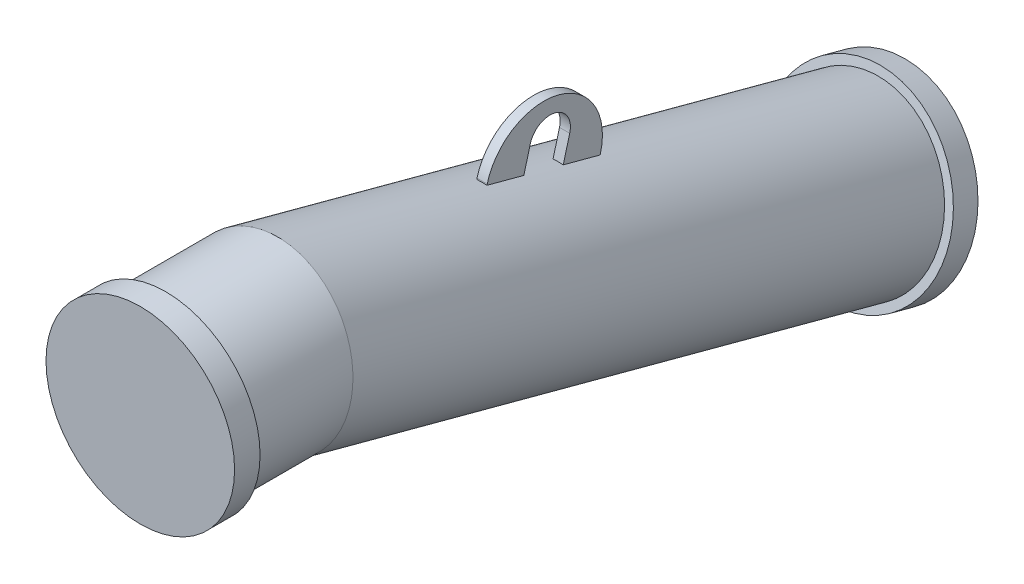
ISO-10303-21;
HEADER;
FILE_DESCRIPTION(('STEP AP214'),'2;1');
FILE_NAME('part.step','',(''),(''),'','','');
FILE_SCHEMA(('AUTOMOTIVE_DESIGN { 1 0 10303 214 1 1 1 1 }'));
ENDSEC;
DATA;
#1=APPLICATION_CONTEXT('core data for automotive mechanical design processes');
#2=APPLICATION_PROTOCOL_DEFINITION('international standard','automotive_design',2000,#1);
#3=PRODUCT_CONTEXT('',#1,'mechanical');
#4=PRODUCT('Part','Part','',(#3));
#5=PRODUCT_RELATED_PRODUCT_CATEGORY('part','',(#4));
#6=PRODUCT_DEFINITION_FORMATION('','',#4);
#7=PRODUCT_DEFINITION_CONTEXT('part definition',#1,'design');
#8=PRODUCT_DEFINITION('design','',#6,#7);
#9=PRODUCT_DEFINITION_SHAPE('','',#8);
#10=(LENGTH_UNIT() NAMED_UNIT(*) SI_UNIT(.MILLI.,.METRE.));
#11=(NAMED_UNIT(*) PLANE_ANGLE_UNIT() SI_UNIT($,.RADIAN.));
#12=(NAMED_UNIT(*) SI_UNIT($,.STERADIAN.) SOLID_ANGLE_UNIT());
#13=UNCERTAINTY_MEASURE_WITH_UNIT(LENGTH_MEASURE(1.E-05),#10,'distance_accuracy_value','');
#14=(GEOMETRIC_REPRESENTATION_CONTEXT(3) GLOBAL_UNCERTAINTY_ASSIGNED_CONTEXT((#13)) GLOBAL_UNIT_ASSIGNED_CONTEXT((#10,
#11,#12)) REPRESENTATION_CONTEXT('',''));
#15=CARTESIAN_POINT('',(0.,0.,0.));
#16=DIRECTION('',(0.,0.,1.));
#17=DIRECTION('',(1.,0.,0.));
#18=AXIS2_PLACEMENT_3D('',#15,#16,#17);
#19=CARTESIAN_POINT('',(0.,-3.60822483003176E-13,-24.9999999999999));
#20=DIRECTION('',(0.,0.,0.999999999999996));
#21=DIRECTION('',(1.,0.,0.));
#22=AXIS2_PLACEMENT_3D('',#19,#20,#21);
#23=CYLINDRICAL_SURFACE('',#22,92.5);
#24=CARTESIAN_POINT('',(0.,-3.60822483003176E-13,-24.9999999999999));
#25=DIRECTION('',(0.,0.,0.999999999999996));
#26=DIRECTION('',(1.,0.,0.));
#27=AXIS2_PLACEMENT_3D('',#24,#25,#26);
#28=CIRCLE('',#27,92.5);
#29=CARTESIAN_POINT('',(92.5000000000001,-3.16711467399868E-13,-24.9999999999999));
#30=VERTEX_POINT('',#29);
#31=EDGE_CURVE('E27',#30,#30,#28,.T.);
#32=ORIENTED_EDGE('',*,*,#31,.T.);
#33=EDGE_LOOP('',(#32));
#34=FACE_BOUND('',#33,.T.);
#35=CARTESIAN_POINT('',(0.,0.,0.));
#36=DIRECTION('',(0.,0.,0.999999999999996));
#37=DIRECTION('',(1.,0.,0.));
#38=AXIS2_PLACEMENT_3D('',#35,#36,#37);
#39=CIRCLE('',#38,92.5);
#40=CARTESIAN_POINT('',(92.5000000000001,0.,0.));
#41=VERTEX_POINT('',#40);
#42=EDGE_CURVE('E20',#41,#41,#39,.T.);
#43=ORIENTED_EDGE('',*,*,#42,.F.);
#44=EDGE_LOOP('',(#43));
#45=FACE_BOUND('',#44,.T.);
#46=ADVANCED_FACE('F17',(#34,#45),#23,.T.);
#47=CARTESIAN_POINT('',(0.,-3.60822483003176E-13,-24.9999999999999));
#48=DIRECTION('',(0.,0.,0.999999999999996));
#49=DIRECTION('',(1.,0.,0.));
#50=AXIS2_PLACEMENT_3D('',#47,#48,#49);
#51=PLANE('',#50);
#52=CARTESIAN_POINT('',(0.,0.,-25.));
#53=DIRECTION('',(0.,0.,-1.));
#54=DIRECTION('',(-1.,0.,0.));
#55=AXIS2_PLACEMENT_3D('',#52,#53,#54);
#56=CIRCLE('',#55,84.15);
#57=CARTESIAN_POINT('',(-84.1500000000002,0.,-25.));
#58=VERTEX_POINT('',#57);
#59=EDGE_CURVE('E10',#58,#58,#56,.T.);
#60=ORIENTED_EDGE('',*,*,#59,.F.);
#61=EDGE_LOOP('',(#60));
#62=FACE_BOUND('',#61,.T.);
#63=ORIENTED_EDGE('',*,*,#31,.F.);
#64=EDGE_LOOP('',(#63));
#65=FACE_BOUND('',#64,.T.);
#66=ADVANCED_FACE('F370',(#62,#65),#51,.F.);
#67=CARTESIAN_POINT('',(5.00000000000008,39.1303698782752,-396.914653295318));
#68=DIRECTION('',(1.,0.,0.));
#69=DIRECTION('',(0.,0.965925826289069,-0.258819045102522));
#70=AXIS2_PLACEMENT_3D('',#67,#68,#69);
#71=PLANE('',#70);
#72=DIRECTION('',(0.,0.965925826289068,-0.258819045102522));
#73=VECTOR('',#72,1.);
#74=CARTESIAN_POINT('',(5.00000000000008,21.6539497909864,-332.703480272761));
#75=LINE('',#74,#73);
#76=CARTESIAN_POINT('',(5.00000000000008,30.348561494267,-335.033194457158));
#77=VERTEX_POINT('',#76);
#78=CARTESIAN_POINT('',(5.00000000000008,31.3132080538771,-335.291670723787));
#79=VERTEX_POINT('',#78);
#80=EDGE_CURVE('E296',#77,#79,#75,.T.);
#81=ORIENTED_EDGE('',*,*,#80,.F.);
#82=DIRECTION('',(0.,-0.258819045102519,-0.96592582628906));
#83=VECTOR('',#82,1.);
#84=CARTESIAN_POINT('',(5.00000000000007,-48.2704738762997,-628.443428902165));
#85=LINE('',#84,#83);
#86=CARTESIAN_POINT('',(5.00000000000008,20.6428473029213,-371.255412942999));
#87=VERTEX_POINT('',#86);
#88=EDGE_CURVE('E52',#77,#87,#85,.T.);
#89=ORIENTED_EDGE('',*,*,#88,.T.);
#90=DIRECTION('',(0.,0.965925826289069,-0.258819045102522));
#91=VECTOR('',#90,1.);
#92=CARTESIAN_POINT('',(5.00000000000009,21.6074938625328,-371.513889209626));
#93=LINE('',#92,#91);
#94=CARTESIAN_POINT('',(5.0000000000001,44.3067507803256,-377.596136769536));
#95=VERTEX_POINT('',#94);
#96=EDGE_CURVE('E309',#87,#95,#93,.T.);
#97=ORIENTED_EDGE('',*,*,#96,.T.);
#98=CARTESIAN_POINT('',(5.00000000000008,39.1303698782752,-396.914653295318));
#99=DIRECTION('',(-1.,0.,0.));
#100=DIRECTION('',(0.,0.965925826289069,-0.258819045102522));
#101=AXIS2_PLACEMENT_3D('',#98,#99,#100);
#102=CIRCLE('',#101,20.);
#103=CARTESIAN_POINT('',(5.00000000000009,33.9539889762251,-416.233169821099));
#104=VERTEX_POINT('',#103);
#105=EDGE_CURVE('E312',#95,#104,#102,.T.);
#106=ORIENTED_EDGE('',*,*,#105,.T.);
#107=DIRECTION('',(0.,-0.965925826289069,0.258819045102521));
#108=VECTOR('',#107,1.);
#109=CARTESIAN_POINT('',(5.00000000000009,11.2547320584318,-410.150922261189));
#110=LINE('',#109,#108);
#111=CARTESIAN_POINT('',(5.00000000000008,10.2900854988205,-409.892445994562));
#112=VERTEX_POINT('',#111);
#113=EDGE_CURVE('E316',#104,#112,#110,.T.);
#114=ORIENTED_EDGE('',*,*,#113,.T.);
#115=CARTESIAN_POINT('',(5.00000000000009,0.584371307477155,-446.1146644804));
#116=VERTEX_POINT('',#115);
#117=EDGE_CURVE('E286',#112,#116,#85,.T.);
#118=ORIENTED_EDGE('',*,*,#117,.T.);
#119=DIRECTION('',(0.,0.965925826289068,-0.258819045102522));
#120=VECTOR('',#119,1.);
#121=CARTESIAN_POINT('',(5.00000000000009,-8.11024039580356,-443.784950296004));
#122=LINE('',#121,#120);
#123=CARTESIAN_POINT('',(5.00000000000009,1.54901786708718,-446.373140747029));
#124=VERTEX_POINT('',#123);
#125=EDGE_CURVE('E302',#116,#124,#122,.T.);
#126=ORIENTED_EDGE('',*,*,#125,.T.);
#127=CARTESIAN_POINT('',(5.00000000000009,16.4311129604822,-390.832405735408));
#128=DIRECTION('',(1.,0.,0.));
#129=DIRECTION('',(0.,0.965925826289069,-0.258819045102522));
#130=AXIS2_PLACEMENT_3D('',#127,#128,#129);
#131=CIRCLE('',#130,57.5);
#132=EDGE_CURVE('E319',#124,#79,#131,.T.);
#133=ORIENTED_EDGE('',*,*,#132,.T.);
#134=EDGE_LOOP('',(#81,#89,#97,#106,#114,#118,#126,#133));
#135=FACE_BOUND('',#134,.T.);
#136=ADVANCED_FACE('F375',(#135),#71,.T.);
#137=CARTESIAN_POINT('',(-4.99999999999992,39.1303698782754,-396.914653295317));
#138=DIRECTION('',(1.,0.,0.));
#139=DIRECTION('',(0.,0.965925826289069,-0.258819045102522));
#140=AXIS2_PLACEMENT_3D('',#137,#138,#139);
#141=PLANE('',#140);
#142=DIRECTION('',(0.,-0.258819045102519,-0.96592582628906));
#143=VECTOR('',#142,1.);
#144=CARTESIAN_POINT('',(-4.99999999999993,-48.2704738762997,-628.443428902165));
#145=LINE('',#144,#143);
#146=CARTESIAN_POINT('',(-4.99999999999992,30.348561494267,-335.033194457158));
#147=VERTEX_POINT('',#146);
#148=CARTESIAN_POINT('',(-4.99999999999992,20.6428473029213,-371.255412942999));
#149=VERTEX_POINT('',#148);
#150=EDGE_CURVE('E278',#147,#149,#145,.T.);
#151=ORIENTED_EDGE('',*,*,#150,.F.);
#152=DIRECTION('',(0.,0.965925826289068,-0.258819045102522));
#153=VECTOR('',#152,1.);
#154=CARTESIAN_POINT('',(-4.99999999999992,21.6539497909864,-332.703480272761));
#155=LINE('',#154,#153);
#156=CARTESIAN_POINT('',(-4.99999999999992,31.3132080538771,-335.291670723787));
#157=VERTEX_POINT('',#156);
#158=EDGE_CURVE('E299',#147,#157,#155,.T.);
#159=ORIENTED_EDGE('',*,*,#158,.T.);
#160=CARTESIAN_POINT('',(-4.99999999999991,16.4311129604822,-390.832405735408));
#161=DIRECTION('',(1.,0.,0.));
#162=DIRECTION('',(0.,0.965925826289069,-0.258819045102522));
#163=AXIS2_PLACEMENT_3D('',#160,#161,#162);
#164=CIRCLE('',#163,57.5);
#165=CARTESIAN_POINT('',(-4.99999999999992,1.54901786708704,-446.37314074703));
#166=VERTEX_POINT('',#165);
#167=EDGE_CURVE('E313',#166,#157,#164,.T.);
#168=ORIENTED_EDGE('',*,*,#167,.F.);
#169=DIRECTION('',(0.,0.965925826289068,-0.258819045102522));
#170=VECTOR('',#169,1.);
#171=CARTESIAN_POINT('',(-4.99999999999992,-8.11024039580364,-443.784950296004));
#172=LINE('',#171,#170);
#173=CARTESIAN_POINT('',(-4.99999999999992,0.584371307477086,-446.114664480401));
#174=VERTEX_POINT('',#173);
#175=EDGE_CURVE('E305',#174,#166,#172,.T.);
#176=ORIENTED_EDGE('',*,*,#175,.F.);
#177=CARTESIAN_POINT('',(-4.99999999999993,10.2900854988205,-409.892445994562));
#178=VERTEX_POINT('',#177);
#179=EDGE_CURVE('E282',#178,#174,#145,.T.);
#180=ORIENTED_EDGE('',*,*,#179,.F.);
#181=DIRECTION('',(0.,-0.965925826289069,0.258819045102521));
#182=VECTOR('',#181,1.);
#183=CARTESIAN_POINT('',(-4.99999999999991,11.2547320584318,-410.150922261189));
#184=LINE('',#183,#182);
#185=CARTESIAN_POINT('',(-4.99999999999991,33.9539889762251,-416.233169821099));
#186=VERTEX_POINT('',#185);
#187=EDGE_CURVE('E329',#186,#178,#184,.T.);
#188=ORIENTED_EDGE('',*,*,#187,.F.);
#189=CARTESIAN_POINT('',(-4.99999999999992,39.1303698782754,-396.914653295317));
#190=DIRECTION('',(-1.,0.,0.));
#191=DIRECTION('',(0.,0.965925826289069,-0.258819045102522));
#192=AXIS2_PLACEMENT_3D('',#189,#190,#191);
#193=CIRCLE('',#192,20.);
#194=CARTESIAN_POINT('',(-4.99999999999991,44.3067507803256,-377.596136769536));
#195=VERTEX_POINT('',#194);
#196=EDGE_CURVE('E326',#195,#186,#193,.T.);
#197=ORIENTED_EDGE('',*,*,#196,.F.);
#198=DIRECTION('',(0.,0.965925826289069,-0.258819045102522));
#199=VECTOR('',#198,1.);
#200=CARTESIAN_POINT('',(-4.99999999999991,21.6074938625327,-371.513889209626));
#201=LINE('',#200,#199);
#202=EDGE_CURVE('E308',#149,#195,#201,.T.);
#203=ORIENTED_EDGE('',*,*,#202,.F.);
#204=EDGE_LOOP('',(#151,#159,#168,#176,#180,#188,#197,#203));
#205=FACE_BOUND('',#204,.T.);
#206=ADVANCED_FACE('F381',(#205),#141,.F.);
#207=CARTESIAN_POINT('',(5.00000000000009,21.6074938625328,-371.513889209626));
#208=DIRECTION('',(0.,0.258819045102522,0.965925826289068));
#209=DIRECTION('',(0.,-0.965925826289069,0.258819045102522));
#210=AXIS2_PLACEMENT_3D('',#207,#208,#209);
#211=PLANE('',#210);
#212=CARTESIAN_POINT('',(0.,-60.4962013720383,-349.514270375912));
#213=DIRECTION('',(0.,0.258819045102522,0.965925826289068));
#214=DIRECTION('',(0.,-0.965925826289068,0.258819045102522));
#215=AXIS2_PLACEMENT_3D('',#212,#213,#214);
#216=CIRCLE('',#215,84.15);
#217=EDGE_CURVE('E285',#149,#87,#216,.F.);
#218=ORIENTED_EDGE('',*,*,#217,.F.);
#219=ORIENTED_EDGE('',*,*,#202,.T.);
#220=DIRECTION('',(-1.,0.,0.));
#221=VECTOR('',#220,1.);
#222=CARTESIAN_POINT('',(5.0000000000001,44.3067507803256,-377.596136769536));
#223=LINE('',#222,#221);
#224=EDGE_CURVE('E346',#95,#195,#223,.T.);
#225=ORIENTED_EDGE('',*,*,#224,.F.);
#226=ORIENTED_EDGE('',*,*,#96,.F.);
#227=EDGE_LOOP('',(#218,#219,#225,#226));
#228=FACE_BOUND('',#227,.T.);
#229=ADVANCED_FACE('F386',(#228),#211,.F.);
#230=CARTESIAN_POINT('',(5.00000000000008,39.1303698782752,-396.914653295318));
#231=DIRECTION('',(-1.,0.,0.));
#232=DIRECTION('',(0.,-0.965925826289069,0.258819045102522));
#233=AXIS2_PLACEMENT_3D('',#230,#231,#232);
#234=CYLINDRICAL_SURFACE('',#233,20.);
#235=ORIENTED_EDGE('',*,*,#196,.T.);
#236=DIRECTION('',(-1.,0.,0.));
#237=VECTOR('',#236,1.);
#238=CARTESIAN_POINT('',(5.00000000000009,33.9539889762251,-416.233169821099));
#239=LINE('',#238,#237);
#240=EDGE_CURVE('E342',#104,#186,#239,.T.);
#241=ORIENTED_EDGE('',*,*,#240,.F.);
#242=ORIENTED_EDGE('',*,*,#105,.F.);
#243=ORIENTED_EDGE('',*,*,#224,.T.);
#244=EDGE_LOOP('',(#235,#241,#242,#243));
#245=FACE_BOUND('',#244,.T.);
#246=ADVANCED_FACE('F425',(#245),#234,.F.);
#247=CARTESIAN_POINT('',(5.00000000000009,11.2547320584318,-410.150922261189));
#248=DIRECTION('',(0.,-0.258819045102521,-0.965925826289069));
#249=DIRECTION('',(0.,0.965925826289069,-0.258819045102521));
#250=AXIS2_PLACEMENT_3D('',#247,#248,#249);
#251=PLANE('',#250);
#252=CARTESIAN_POINT('',(0.,-70.8489631761392,-388.151303427475));
#253=DIRECTION('',(0.,-0.258819045102521,-0.965925826289069));
#254=DIRECTION('',(0.,0.965925826289068,-0.258819045102521));
#255=AXIS2_PLACEMENT_3D('',#252,#253,#254);
#256=CIRCLE('',#255,84.15);
#257=EDGE_CURVE('E40',#112,#178,#256,.F.);
#258=ORIENTED_EDGE('',*,*,#257,.F.);
#259=ORIENTED_EDGE('',*,*,#113,.F.);
#260=ORIENTED_EDGE('',*,*,#240,.T.);
#261=ORIENTED_EDGE('',*,*,#187,.T.);
#262=EDGE_LOOP('',(#258,#259,#260,#261));
#263=FACE_BOUND('',#262,.T.);
#264=ADVANCED_FACE('F422',(#263),#251,.F.);
#265=CARTESIAN_POINT('',(5.00000000000009,16.4311129604822,-390.832405735408));
#266=DIRECTION('',(-1.,0.,0.));
#267=DIRECTION('',(0.,-0.965925826289069,0.258819045102522));
#268=AXIS2_PLACEMENT_3D('',#265,#266,#267);
#269=CYLINDRICAL_SURFACE('',#268,57.5);
#270=ORIENTED_EDGE('',*,*,#167,.T.);
#271=DIRECTION('',(-1.,0.,0.));
#272=VECTOR('',#271,1.);
#273=CARTESIAN_POINT('',(5.00000000000008,31.3132080538771,-335.291670723787));
#274=LINE('',#273,#272);
#275=EDGE_CURVE('E323',#79,#157,#274,.T.);
#276=ORIENTED_EDGE('',*,*,#275,.F.);
#277=ORIENTED_EDGE('',*,*,#132,.F.);
#278=DIRECTION('',(-1.,0.,0.));
#279=VECTOR('',#278,1.);
#280=CARTESIAN_POINT('',(5.00000000000009,1.54901786708718,-446.373140747029));
#281=LINE('',#280,#279);
#282=EDGE_CURVE('E338',#124,#166,#281,.T.);
#283=ORIENTED_EDGE('',*,*,#282,.T.);
#284=EDGE_LOOP('',(#270,#276,#277,#283));
#285=FACE_BOUND('',#284,.T.);
#286=ADVANCED_FACE('F414',(#285),#269,.T.);
#287=CARTESIAN_POINT('',(-4.99999999999992,-8.11024039580364,-443.784950296004));
#288=DIRECTION('',(0.,0.258819045102522,0.965925826289068));
#289=DIRECTION('',(0.,-0.965925826289068,0.258819045102522));
#290=AXIS2_PLACEMENT_3D('',#287,#288,#289);
#291=PLANE('',#290);
#292=CARTESIAN_POINT('',(0.,-80.5546773674837,-424.373521913315));
#293=DIRECTION('',(0.,0.258819045102522,0.965925826289068));
#294=DIRECTION('',(0.,-0.965925826289068,0.258819045102522));
#295=AXIS2_PLACEMENT_3D('',#292,#293,#294);
#296=CIRCLE('',#295,84.15);
#297=EDGE_CURVE('E290',#174,#116,#296,.F.);
#298=ORIENTED_EDGE('',*,*,#297,.F.);
#299=ORIENTED_EDGE('',*,*,#175,.T.);
#300=ORIENTED_EDGE('',*,*,#282,.F.);
#301=ORIENTED_EDGE('',*,*,#125,.F.);
#302=EDGE_LOOP('',(#298,#299,#300,#301));
#303=FACE_BOUND('',#302,.T.);
#304=ADVANCED_FACE('F411',(#303),#291,.F.);
#305=CARTESIAN_POINT('',(5.00000000000008,21.6539497909864,-332.703480272761));
#306=DIRECTION('',(0.,-0.258819045102522,-0.965925826289068));
#307=DIRECTION('',(0.,0.965925826289068,-0.258819045102522));
#308=AXIS2_PLACEMENT_3D('',#305,#306,#307);
#309=PLANE('',#308);
#310=CARTESIAN_POINT('',(0.,-50.7904871806938,-313.292051890072));
#311=DIRECTION('',(0.,-0.258819045102522,-0.965925826289068));
#312=DIRECTION('',(0.,0.965925826289068,-0.258819045102522));
#313=AXIS2_PLACEMENT_3D('',#310,#311,#312);
#314=CIRCLE('',#313,84.15);
#315=EDGE_CURVE('E350',#77,#147,#314,.F.);
#316=ORIENTED_EDGE('',*,*,#315,.F.);
#317=ORIENTED_EDGE('',*,*,#80,.T.);
#318=ORIENTED_EDGE('',*,*,#275,.T.);
#319=ORIENTED_EDGE('',*,*,#158,.F.);
#320=EDGE_LOOP('',(#316,#317,#318,#319));
#321=FACE_BOUND('',#320,.T.);
#322=ADVANCED_FACE('F408',(#321),#309,.F.);
#323=CARTESIAN_POINT('',(0.,-129.40952255126,-606.702286335079));
#324=DIRECTION('',(0.,-0.258819045102519,-0.96592582628906));
#325=DIRECTION('',(-1.,0.,0.));
#326=AXIS2_PLACEMENT_3D('',#323,#324,#325);
#327=CYLINDRICAL_SURFACE('',#326,84.15);
#328=CARTESIAN_POINT('',(0.,-154.965152834459,-702.077196971422));
#329=DIRECTION('',(0.,0.258819045102519,0.96592582628906));
#330=DIRECTION('',(1.,0.,0.));
#331=AXIS2_PLACEMENT_3D('',#328,#329,#330);
#332=CIRCLE('',#331,84.15);
#333=CARTESIAN_POINT('',(84.15,-154.965152834459,-702.077196971422));
#334=VERTEX_POINT('',#333);
#335=EDGE_CURVE('E267',#334,#334,#332,.T.);
#336=ORIENTED_EDGE('',*,*,#335,.T.);
#337=EDGE_LOOP('',(#336));
#338=FACE_BOUND('',#337,.T.);
#339=CARTESIAN_POINT('',(0.,0.,-123.739373190547));
#340=DIRECTION('',(0.,-0.130526192220052,-0.991444861373812));
#341=DIRECTION('',(0.,-0.991444861373812,0.130526192220052));
#342=AXIS2_PLACEMENT_3D('',#339,#340,#341);
#343=ELLIPSE('',#342,84.8761270328199,84.15);
#344=CARTESIAN_POINT('',(0.,-84.1500000000001,-112.660815518567));
#345=VERTEX_POINT('',#344);
#346=EDGE_CURVE('E273',#345,#345,#343,.T.);
#347=ORIENTED_EDGE('',*,*,#346,.T.);
#348=EDGE_LOOP('',(#347));
#349=FACE_BOUND('',#348,.T.);
#350=ORIENTED_EDGE('',*,*,#150,.T.);
#351=ORIENTED_EDGE('',*,*,#217,.T.);
#352=ORIENTED_EDGE('',*,*,#88,.F.);
#353=ORIENTED_EDGE('',*,*,#315,.T.);
#354=EDGE_LOOP('',(#350,#351,#352,#353));
#355=FACE_BOUND('',#354,.T.);
#356=ORIENTED_EDGE('',*,*,#117,.F.);
#357=ORIENTED_EDGE('',*,*,#257,.T.);
#358=ORIENTED_EDGE('',*,*,#179,.T.);
#359=ORIENTED_EDGE('',*,*,#297,.T.);
#360=EDGE_LOOP('',(#356,#357,#358,#359));
#361=FACE_BOUND('',#360,.T.);
#362=ADVANCED_FACE('F406',(#338,#349,#355,#361),#327,.T.);
#363=CARTESIAN_POINT('',(0.,-161.435628962022,-726.225342628649));
#364=DIRECTION('',(0.,-0.258819045102521,-0.965925826289064));
#365=DIRECTION('',(-1.,0.,0.));
#366=AXIS2_PLACEMENT_3D('',#363,#364,#365);
#367=PLANE('',#366);
#368=CARTESIAN_POINT('',(0.,-161.435628962022,-726.225342628649));
#369=DIRECTION('',(0.,-0.258819045102521,-0.965925826289064));
#370=DIRECTION('',(-1.,0.,0.));
#371=AXIS2_PLACEMENT_3D('',#368,#369,#370);
#372=CIRCLE('',#371,92.5);
#373=CARTESIAN_POINT('',(-92.5000000000001,-161.435628962021,-726.225342628649));
#374=VERTEX_POINT('',#373);
#375=EDGE_CURVE('E255',#374,#374,#372,.T.);
#376=ORIENTED_EDGE('',*,*,#375,.T.);
#377=EDGE_LOOP('',(#376));
#378=FACE_BOUND('',#377,.T.);
#379=ADVANCED_FACE('F456',(#378),#367,.T.);
#380=CARTESIAN_POINT('',(0.,-154.965152834459,-702.077196971422));
#381=DIRECTION('',(0.,-0.258819045102521,-0.965925826289064));
#382=DIRECTION('',(-1.,0.,0.));
#383=AXIS2_PLACEMENT_3D('',#380,#381,#382);
#384=CYLINDRICAL_SURFACE('',#383,92.5);
#385=CARTESIAN_POINT('',(0.,-154.965152834459,-702.077196971422));
#386=DIRECTION('',(0.,-0.258819045102521,-0.965925826289064));
#387=DIRECTION('',(-1.,0.,0.));
#388=AXIS2_PLACEMENT_3D('',#385,#386,#387);
#389=CIRCLE('',#388,92.5);
#390=CARTESIAN_POINT('',(-92.5000000000001,-154.965152834459,-702.077196971422));
#391=VERTEX_POINT('',#390);
#392=EDGE_CURVE('E263',#391,#391,#389,.T.);
#393=ORIENTED_EDGE('',*,*,#392,.T.);
#394=EDGE_LOOP('',(#393));
#395=FACE_BOUND('',#394,.T.);
#396=ORIENTED_EDGE('',*,*,#375,.F.);
#397=EDGE_LOOP('',(#396));
#398=FACE_BOUND('',#397,.T.);
#399=ADVANCED_FACE('F400',(#395,#398),#384,.T.);
#400=CARTESIAN_POINT('',(0.,-154.965152834459,-702.077196971422));
#401=DIRECTION('',(0.,-0.258819045102521,-0.965925826289064));
#402=DIRECTION('',(-1.,0.,0.));
#403=AXIS2_PLACEMENT_3D('',#400,#401,#402);
#404=PLANE('',#403);
#405=ORIENTED_EDGE('',*,*,#335,.F.);
#406=EDGE_LOOP('',(#405));
#407=FACE_BOUND('',#406,.T.);
#408=ORIENTED_EDGE('',*,*,#392,.F.);
#409=EDGE_LOOP('',(#408));
#410=FACE_BOUND('',#409,.T.);
#411=ADVANCED_FACE('F394',(#407,#410),#404,.F.);
#412=CARTESIAN_POINT('',(0.,0.,-123.739373190547));
#413=DIRECTION('',(0.,0.,1.));
#414=DIRECTION('',(1.,0.,0.));
#415=AXIS2_PLACEMENT_3D('',#412,#413,#414);
#416=CYLINDRICAL_SURFACE('',#415,84.15);
#417=ORIENTED_EDGE('',*,*,#59,.T.);
#418=EDGE_LOOP('',(#417));
#419=FACE_BOUND('',#418,.T.);
#420=ORIENTED_EDGE('',*,*,#346,.F.);
#421=EDGE_LOOP('',(#420));
#422=FACE_BOUND('',#421,.T.);
#423=ADVANCED_FACE('F389',(#419,#422),#416,.T.);
#424=CARTESIAN_POINT('',(0.,0.,0.));
#425=DIRECTION('',(0.,0.,0.999999999999996));
#426=DIRECTION('',(1.,0.,0.));
#427=AXIS2_PLACEMENT_3D('',#424,#425,#426);
#428=PLANE('',#427);
#429=ORIENTED_EDGE('',*,*,#42,.T.);
#430=EDGE_LOOP('',(#429));
#431=FACE_BOUND('',#430,.T.);
#432=ADVANCED_FACE('F367',(#431),#428,.T.);
#433=CLOSED_SHELL('',(#46,#66,#136,#206,#229,#246,#264,#286,#304,#322,#362,#379,#399,#411,#423,#432));
#434=CARTESIAN_POINT('',(0.,0.,-25.));
#435=DIRECTION('',(0.,0.,1.));
#436=DIRECTION('',(1.,0.,0.));
#437=AXIS2_PLACEMENT_3D('',#434,#435,#436);
#438=PLANE('',#437);
#439=CARTESIAN_POINT('',(0.,0.,-25.));
#440=DIRECTION('',(0.,0.,1.));
#441=DIRECTION('',(1.,0.,0.));
#442=AXIS2_PLACEMENT_3D('',#439,#440,#441);
#443=CIRCLE('',#442,35.);
#444=CARTESIAN_POINT('',(0.,35.,-25.));
#445=VERTEX_POINT('',#444);
#446=EDGE_CURVE('E256',#445,#445,#443,.F.);
#447=ORIENTED_EDGE('',*,*,#446,.T.);
#448=EDGE_LOOP('',(#447));
#449=FACE_BOUND('',#448,.T.);
#450=ADVANCED_FACE('F484',(#449),#438,.F.);
#451=CARTESIAN_POINT('',(0.,-750.,-25.));
#452=DIRECTION('',(-1.,0.,0.));
#453=DIRECTION('',(0.,0.,1.));
#454=AXIS2_PLACEMENT_3D('',#451,#452,#453);
#455=TOROIDAL_SURFACE('',#454,750.,35.);
#456=CARTESIAN_POINT('',(0.,-25.5556302831973,-219.114283826888));
#457=DIRECTION('',(0.,0.258819045102523,0.965925826289069));
#458=DIRECTION('',(1.,0.,0.));
#459=AXIS2_PLACEMENT_3D('',#456,#457,#458);
#460=CIRCLE('',#459,35.);
#461=CARTESIAN_POINT('',(0.,8.25177363691953,-228.172950405476));
#462=VERTEX_POINT('',#461);
#463=EDGE_CURVE('E250',#462,#462,#460,.T.);
#464=CARTESIAN_POINT('',(0.,-750.,-25.));
#465=DIRECTION('',(-1.,0.,0.));
#466=DIRECTION('',(0.,0.,1.));
#467=AXIS2_PLACEMENT_3D('',#464,#465,#466);
#468=CIRCLE('',#467,785.);
#469=EDGE_CURVE('',#445,#462,#468,.T.);
#470=ORIENTED_EDGE('',*,*,#446,.F.);
#471=ORIENTED_EDGE('',*,*,#463,.F.);
#472=ORIENTED_EDGE('',*,*,#469,.T.);
#473=ORIENTED_EDGE('',*,*,#469,.F.);
#474=EDGE_LOOP('',(#470,#472,#471,#473));
#475=FACE_BOUND('',#474,.T.);
#476=ADVANCED_FACE('F479',(#475),#455,.F.);
#477=CARTESIAN_POINT('',(0.,-154.965152834459,-702.077196971422));
#478=DIRECTION('',(0.,-0.258819045102521,-0.965925826289064));
#479=DIRECTION('',(-1.,0.,0.));
#480=AXIS2_PLACEMENT_3D('',#477,#478,#479);
#481=CYLINDRICAL_SURFACE('',#480,35.);
#482=CARTESIAN_POINT('',(0.,-160.141533736509,-721.395713497203));
#483=DIRECTION('',(0.,0.258819045102521,0.965925826289064));
#484=DIRECTION('',(0.,-0.965925826289068,0.258819045102522));
#485=AXIS2_PLACEMENT_3D('',#482,#483,#484);
#486=CIRCLE('',#485,35.);
#487=CARTESIAN_POINT('',(0.,-193.948937656627,-712.337046918615));
#488=VERTEX_POINT('',#487);
#489=EDGE_CURVE('E251',#488,#488,#486,.F.);
#490=ORIENTED_EDGE('',*,*,#489,.T.);
#491=EDGE_LOOP('',(#490));
#492=FACE_BOUND('',#491,.T.);
#493=ORIENTED_EDGE('',*,*,#463,.T.);
#494=EDGE_LOOP('',(#493));
#495=FACE_BOUND('',#494,.T.);
#496=ADVANCED_FACE('F475',(#492,#495),#481,.F.);
#497=CARTESIAN_POINT('',(0.,-160.141533736509,-721.395713497203));
#498=DIRECTION('',(0.,0.258819045102521,0.965925826289064));
#499=DIRECTION('',(1.,0.,0.));
#500=AXIS2_PLACEMENT_3D('',#497,#498,#499);
#501=PLANE('',#500);
#502=ORIENTED_EDGE('',*,*,#489,.F.);
#503=EDGE_LOOP('',(#502));
#504=FACE_BOUND('',#503,.T.);
#505=ADVANCED_FACE('F478',(#504),#501,.T.);
#506=CLOSED_SHELL('',(#450,#476,#496,#505));
#507=CARTESIAN_POINT('',(-27.74454884647,-66.9812661070679,-19.9999999999998));
#508=DIRECTION('',(0.,0.,0.999999999999996));
#509=DIRECTION('',(0.,-1.,0.));
#510=AXIS2_PLACEMENT_3D('',#507,#508,#509);
#511=PLANE('',#510);
#512=CARTESIAN_POINT('',(-27.74454884647,-66.9812661070679,-19.9999999999998));
#513=DIRECTION('',(0.,0.,0.999999999999996));
#514=DIRECTION('',(1.,0.,0.));
#515=AXIS2_PLACEMENT_3D('',#512,#513,#514);
#516=CIRCLE('',#515,7.);
#517=CARTESIAN_POINT('',(-20.74454884647,-66.9812661070679,-19.9999999999998));
#518=VERTEX_POINT('',#517);
#519=EDGE_CURVE('E224',#518,#518,#516,.T.);
#520=ORIENTED_EDGE('',*,*,#519,.F.);
#521=EDGE_LOOP('',(#520));
#522=FACE_BOUND('',#521,.T.);
#523=ADVANCED_FACE('F551',(#522),#511,.F.);
#524=CARTESIAN_POINT('',(-27.74454884647,-66.9812661070679,-19.9999999999998));
#525=DIRECTION('',(0.,0.,0.999999999999996));
#526=DIRECTION('',(1.,0.,0.));
#527=AXIS2_PLACEMENT_3D('',#524,#525,#526);
#528=CONICAL_SURFACE('',#527,7.,1.02974425867665);
#529=CARTESIAN_POINT('',(-27.7445488464701,-66.9812661070681,-24.206024333193));
#530=VERTEX_POINT('',#529);
#531=VERTEX_LOOP('',#530);
#532=FACE_BOUND('',#531,.T.);
#533=ORIENTED_EDGE('',*,*,#519,.T.);
#534=EDGE_LOOP('',(#533));
#535=FACE_BOUND('',#534,.T.);
#536=ADVANCED_FACE('F554',(#532,#535),#528,.F.);
#537=CLOSED_SHELL('',(#523,#536));
#538=CARTESIAN_POINT('',(-66.9812661070688,-27.7445488464683,-20.));
#539=DIRECTION('',(0.,0.,0.999999999999996));
#540=DIRECTION('',(0.,-1.,0.));
#541=AXIS2_PLACEMENT_3D('',#538,#539,#540);
#542=PLANE('',#541);
#543=CARTESIAN_POINT('',(-66.9812661070688,-27.7445488464683,-20.));
#544=DIRECTION('',(0.,0.,0.999999999999996));
#545=DIRECTION('',(1.,0.,0.));
#546=AXIS2_PLACEMENT_3D('',#543,#544,#545);
#547=CIRCLE('',#546,6.99999999999999);
#548=CARTESIAN_POINT('',(-59.9812661070688,-27.7445488464683,-20.));
#549=VERTEX_POINT('',#548);
#550=EDGE_CURVE('E222',#549,#549,#547,.T.);
#551=ORIENTED_EDGE('',*,*,#550,.F.);
#552=EDGE_LOOP('',(#551));
#553=FACE_BOUND('',#552,.T.);
#554=ADVANCED_FACE('F541',(#553),#542,.F.);
#555=CARTESIAN_POINT('',(-66.9812661070688,-27.7445488464683,-20.));
#556=DIRECTION('',(0.,0.,0.999999999999996));
#557=DIRECTION('',(1.,0.,0.));
#558=AXIS2_PLACEMENT_3D('',#555,#556,#557);
#559=CONICAL_SURFACE('',#558,6.99999999999999,1.02974425867665);
#560=CARTESIAN_POINT('',(-66.9812661070688,-27.7445488464677,-24.2060243331924));
#561=VERTEX_POINT('',#560);
#562=VERTEX_LOOP('',#561);
#563=FACE_BOUND('',#562,.T.);
#564=ORIENTED_EDGE('',*,*,#550,.T.);
#565=EDGE_LOOP('',(#564));
#566=FACE_BOUND('',#565,.T.);
#567=ADVANCED_FACE('F544',(#563,#566),#559,.F.);
#568=CLOSED_SHELL('',(#554,#567));
#569=CARTESIAN_POINT('',(-66.9812661070678,27.7445488464698,-20.));
#570=DIRECTION('',(0.,0.,0.999999999999996));
#571=DIRECTION('',(0.,-1.,0.));
#572=AXIS2_PLACEMENT_3D('',#569,#570,#571);
#573=PLANE('',#572);
#574=CARTESIAN_POINT('',(-66.9812661070678,27.7445488464698,-20.));
#575=DIRECTION('',(0.,0.,0.999999999999996));
#576=DIRECTION('',(1.,0.,0.));
#577=AXIS2_PLACEMENT_3D('',#574,#575,#576);
#578=CIRCLE('',#577,6.99999999999999);
#579=CARTESIAN_POINT('',(-59.9812661070678,27.7445488464698,-20.));
#580=VERTEX_POINT('',#579);
#581=EDGE_CURVE('E194',#580,#580,#578,.T.);
#582=ORIENTED_EDGE('',*,*,#581,.F.);
#583=EDGE_LOOP('',(#582));
#584=FACE_BOUND('',#583,.T.);
#585=ADVANCED_FACE('F571',(#584),#573,.F.);
#586=CARTESIAN_POINT('',(-66.9812661070678,27.7445488464698,-20.));
#587=DIRECTION('',(0.,0.,0.999999999999996));
#588=DIRECTION('',(1.,0.,0.));
#589=AXIS2_PLACEMENT_3D('',#586,#587,#588);
#590=CONICAL_SURFACE('',#589,6.99999999999999,1.02974425867665);
#591=CARTESIAN_POINT('',(-66.9812661070678,27.7445488464697,-24.2060243331925));
#592=VERTEX_POINT('',#591);
#593=VERTEX_LOOP('',#592);
#594=FACE_BOUND('',#593,.T.);
#595=ORIENTED_EDGE('',*,*,#581,.T.);
#596=EDGE_LOOP('',(#595));
#597=FACE_BOUND('',#596,.T.);
#598=ADVANCED_FACE('F574',(#594,#597),#590,.F.);
#599=CLOSED_SHELL('',(#585,#598));
#600=CARTESIAN_POINT('',(27.7445488464687,-91.5603132496133,-724.242853436457));
#601=DIRECTION('',(0.,-0.258819045102521,-0.965925826289064));
#602=DIRECTION('',(0.,0.965925826289068,-0.258819045102522));
#603=AXIS2_PLACEMENT_3D('',#600,#601,#602);
#604=PLANE('',#603);
#605=CARTESIAN_POINT('',(27.7445488464687,-91.5603132496133,-724.242853436457));
#606=DIRECTION('',(0.,-0.258819045102521,-0.965925826289064));
#607=DIRECTION('',(-1.,0.,0.));
#608=AXIS2_PLACEMENT_3D('',#605,#606,#607);
#609=CIRCLE('',#608,7.);
#610=CARTESIAN_POINT('',(20.7445488464687,-91.5603132496133,-724.242853436457));
#611=VERTEX_POINT('',#610);
#612=EDGE_CURVE('E185',#611,#611,#609,.T.);
#613=ORIENTED_EDGE('',*,*,#612,.F.);
#614=EDGE_LOOP('',(#613));
#615=FACE_BOUND('',#614,.T.);
#616=ADVANCED_FACE('F561',(#615),#604,.F.);
#617=CARTESIAN_POINT('',(27.7445488464687,-91.5603132496133,-724.242853436457));
#618=DIRECTION('',(0.,-0.258819045102521,-0.965925826289064));
#619=DIRECTION('',(-1.,0.,0.));
#620=AXIS2_PLACEMENT_3D('',#617,#618,#619);
#621=CONICAL_SURFACE('',#620,7.,1.02974425867665);
#622=CARTESIAN_POINT('',(27.7445488464688,-90.4717140480184,-720.180145907025));
#623=VERTEX_POINT('',#622);
#624=VERTEX_LOOP('',#623);
#625=FACE_BOUND('',#624,.T.);
#626=ORIENTED_EDGE('',*,*,#612,.T.);
#627=EDGE_LOOP('',(#626));
#628=FACE_BOUND('',#627,.T.);
#629=ADVANCED_FACE('F564',(#625,#628),#621,.F.);
#630=CLOSED_SHELL('',(#616,#629));
#631=CARTESIAN_POINT('',(27.7445488464686,-66.9812661070689,-20.));
#632=DIRECTION('',(0.,0.,0.999999999999996));
#633=DIRECTION('',(0.,-1.,0.));
#634=AXIS2_PLACEMENT_3D('',#631,#632,#633);
#635=PLANE('',#634);
#636=CARTESIAN_POINT('',(27.7445488464686,-66.9812661070689,-20.));
#637=DIRECTION('',(0.,0.,0.999999999999996));
#638=DIRECTION('',(1.,0.,0.));
#639=AXIS2_PLACEMENT_3D('',#636,#637,#638);
#640=CIRCLE('',#639,6.99999999999999);
#641=CARTESIAN_POINT('',(34.7445488464686,-66.9812661070689,-20.));
#642=VERTEX_POINT('',#641);
#643=EDGE_CURVE('E228',#642,#642,#640,.T.);
#644=ORIENTED_EDGE('',*,*,#643,.F.);
#645=EDGE_LOOP('',(#644));
#646=FACE_BOUND('',#645,.T.);
#647=ADVANCED_FACE('F501',(#646),#635,.F.);
#648=CARTESIAN_POINT('',(27.7445488464686,-66.9812661070689,-20.));
#649=DIRECTION('',(0.,0.,0.999999999999996));
#650=DIRECTION('',(1.,0.,0.));
#651=AXIS2_PLACEMENT_3D('',#648,#649,#650);
#652=CONICAL_SURFACE('',#651,6.99999999999999,1.02974425867665);
#653=CARTESIAN_POINT('',(27.7445488464686,-66.9812661070685,-24.2060243331929));
#654=VERTEX_POINT('',#653);
#655=VERTEX_LOOP('',#654);
#656=FACE_BOUND('',#655,.T.);
#657=ORIENTED_EDGE('',*,*,#643,.T.);
#658=EDGE_LOOP('',(#657));
#659=FACE_BOUND('',#658,.T.);
#660=ADVANCED_FACE('F504',(#656,#659),#652,.F.);
#661=CLOSED_SHELL('',(#647,#660));
#662=CARTESIAN_POINT('',(66.981266107068,-27.7445488464698,-20.));
#663=DIRECTION('',(0.,0.,0.999999999999996));
#664=DIRECTION('',(0.,-1.,0.));
#665=AXIS2_PLACEMENT_3D('',#662,#663,#664);
#666=PLANE('',#665);
#667=CARTESIAN_POINT('',(66.981266107068,-27.7445488464698,-20.));
#668=DIRECTION('',(0.,0.,0.999999999999996));
#669=DIRECTION('',(1.,0.,0.));
#670=AXIS2_PLACEMENT_3D('',#667,#668,#669);
#671=CIRCLE('',#670,6.99999999999999);
#672=CARTESIAN_POINT('',(73.981266107068,-27.7445488464698,-20.));
#673=VERTEX_POINT('',#672);
#674=EDGE_CURVE('E240',#673,#673,#671,.T.);
#675=ORIENTED_EDGE('',*,*,#674,.F.);
#676=EDGE_LOOP('',(#675));
#677=FACE_BOUND('',#676,.T.);
#678=ADVANCED_FACE('F511',(#677),#666,.F.);
#679=CARTESIAN_POINT('',(66.981266107068,-27.7445488464698,-20.));
#680=DIRECTION('',(0.,0.,0.999999999999996));
#681=DIRECTION('',(1.,0.,0.));
#682=AXIS2_PLACEMENT_3D('',#679,#680,#681);
#683=CONICAL_SURFACE('',#682,6.99999999999999,1.02974425867665);
#684=CARTESIAN_POINT('',(66.981266107068,-27.74454884647,-24.2060243331929));
#685=VERTEX_POINT('',#684);
#686=VERTEX_LOOP('',#685);
#687=FACE_BOUND('',#686,.T.);
#688=ORIENTED_EDGE('',*,*,#674,.T.);
#689=EDGE_LOOP('',(#688));
#690=FACE_BOUND('',#689,.T.);
#691=ADVANCED_FACE('F514',(#687,#690),#683,.F.);
#692=CLOSED_SHELL('',(#678,#691));
#693=CARTESIAN_POINT('',(66.9812661070686,27.7445488464682,-20.));
#694=DIRECTION('',(0.,0.,0.999999999999996));
#695=DIRECTION('',(0.,-1.,0.));
#696=AXIS2_PLACEMENT_3D('',#693,#694,#695);
#697=PLANE('',#696);
#698=CARTESIAN_POINT('',(66.9812661070686,27.7445488464682,-20.));
#699=DIRECTION('',(0.,0.,0.999999999999996));
#700=DIRECTION('',(1.,0.,0.));
#701=AXIS2_PLACEMENT_3D('',#698,#699,#700);
#702=CIRCLE('',#701,6.99999999999999);
#703=CARTESIAN_POINT('',(73.9812661070686,27.7445488464682,-20.));
#704=VERTEX_POINT('',#703);
#705=EDGE_CURVE('E236',#704,#704,#702,.T.);
#706=ORIENTED_EDGE('',*,*,#705,.F.);
#707=EDGE_LOOP('',(#706));
#708=FACE_BOUND('',#707,.T.);
#709=ADVANCED_FACE('F521',(#708),#697,.F.);
#710=CARTESIAN_POINT('',(66.9812661070686,27.7445488464682,-20.));
#711=DIRECTION('',(0.,0.,0.999999999999996));
#712=DIRECTION('',(1.,0.,0.));
#713=AXIS2_PLACEMENT_3D('',#710,#711,#712);
#714=CONICAL_SURFACE('',#713,6.99999999999999,1.02974425867665);
#715=CARTESIAN_POINT('',(66.9812661070686,27.7445488464681,-24.2060243331922));
#716=VERTEX_POINT('',#715);
#717=VERTEX_LOOP('',#716);
#718=FACE_BOUND('',#717,.T.);
#719=ORIENTED_EDGE('',*,*,#705,.T.);
#720=EDGE_LOOP('',(#719));
#721=FACE_BOUND('',#720,.T.);
#722=ADVANCED_FACE('F524',(#718,#721),#714,.F.);
#723=CLOSED_SHELL('',(#709,#722));
#724=CARTESIAN_POINT('',(27.7445488464696,66.981266107068,-19.9999999999996));
#725=DIRECTION('',(0.,0.,0.999999999999996));
#726=DIRECTION('',(0.,-1.,0.));
#727=AXIS2_PLACEMENT_3D('',#724,#725,#726);
#728=PLANE('',#727);
#729=CARTESIAN_POINT('',(27.7445488464696,66.981266107068,-19.9999999999996));
#730=DIRECTION('',(0.,0.,0.999999999999996));
#731=DIRECTION('',(1.,0.,0.));
#732=AXIS2_PLACEMENT_3D('',#729,#730,#731);
#733=CIRCLE('',#732,7.);
#734=CARTESIAN_POINT('',(34.7445488464696,66.981266107068,-19.9999999999996));
#735=VERTEX_POINT('',#734);
#736=EDGE_CURVE('E232',#735,#735,#733,.T.);
#737=ORIENTED_EDGE('',*,*,#736,.F.);
#738=EDGE_LOOP('',(#737));
#739=FACE_BOUND('',#738,.T.);
#740=ADVANCED_FACE('F531',(#739),#728,.F.);
#741=CARTESIAN_POINT('',(27.7445488464696,66.981266107068,-19.9999999999996));
#742=DIRECTION('',(0.,0.,0.999999999999996));
#743=DIRECTION('',(1.,0.,0.));
#744=AXIS2_PLACEMENT_3D('',#741,#742,#743);
#745=CONICAL_SURFACE('',#744,7.,1.02974425867665);
#746=CARTESIAN_POINT('',(27.7445488464695,66.9812661070679,-24.2060243331924));
#747=VERTEX_POINT('',#746);
#748=VERTEX_LOOP('',#747);
#749=FACE_BOUND('',#748,.T.);
#750=ORIENTED_EDGE('',*,*,#736,.T.);
#751=EDGE_LOOP('',(#750));
#752=FACE_BOUND('',#751,.T.);
#753=ADVANCED_FACE('F534',(#749,#752),#745,.F.);
#754=CLOSED_SHELL('',(#740,#753));
#755=CARTESIAN_POINT('',(-27.7445488464695,-91.5603132496137,-724.242853436457));
#756=DIRECTION('',(0.,-0.258819045102521,-0.965925826289064));
#757=DIRECTION('',(0.,0.965925826289068,-0.258819045102522));
#758=AXIS2_PLACEMENT_3D('',#755,#756,#757);
#759=PLANE('',#758);
#760=CARTESIAN_POINT('',(-27.7445488464695,-91.5603132496137,-724.242853436457));
#761=DIRECTION('',(0.,-0.258819045102521,-0.965925826289064));
#762=DIRECTION('',(-1.,0.,0.));
#763=AXIS2_PLACEMENT_3D('',#760,#761,#762);
#764=CIRCLE('',#763,7.);
#765=CARTESIAN_POINT('',(-34.7445488464695,-91.5603132496137,-724.242853436457));
#766=VERTEX_POINT('',#765);
#767=EDGE_CURVE('E182',#766,#766,#764,.T.);
#768=ORIENTED_EDGE('',*,*,#767,.F.);
#769=EDGE_LOOP('',(#768));
#770=FACE_BOUND('',#769,.T.);
#771=ADVANCED_FACE('F176',(#770),#759,.F.);
#772=CARTESIAN_POINT('',(-27.7445488464695,-91.5603132496137,-724.242853436457));
#773=DIRECTION('',(0.,-0.258819045102521,-0.965925826289064));
#774=DIRECTION('',(-1.,0.,0.));
#775=AXIS2_PLACEMENT_3D('',#772,#773,#774);
#776=CONICAL_SURFACE('',#775,7.,1.02974425867665);
#777=CARTESIAN_POINT('',(-27.7445488464694,-90.4717140480188,-720.180145907026));
#778=VERTEX_POINT('',#777);
#779=VERTEX_LOOP('',#778);
#780=FACE_BOUND('',#779,.T.);
#781=ORIENTED_EDGE('',*,*,#767,.T.);
#782=EDGE_LOOP('',(#781));
#783=FACE_BOUND('',#782,.T.);
#784=ADVANCED_FACE('F173',(#780,#783),#776,.F.);
#785=CLOSED_SHELL('',(#771,#784));
#786=CARTESIAN_POINT('',(-66.9812661070686,-129.460071790429,-714.087643742111));
#787=DIRECTION('',(0.,-0.258819045102521,-0.965925826289064));
#788=DIRECTION('',(0.,0.965925826289068,-0.258819045102522));
#789=AXIS2_PLACEMENT_3D('',#786,#787,#788);
#790=PLANE('',#789);
#791=CARTESIAN_POINT('',(-66.9812661070686,-129.460071790429,-714.087643742111));
#792=DIRECTION('',(0.,-0.258819045102521,-0.965925826289064));
#793=DIRECTION('',(-1.,0.,0.));
#794=AXIS2_PLACEMENT_3D('',#791,#792,#793);
#795=CIRCLE('',#794,6.99999999999999);
#796=CARTESIAN_POINT('',(-73.9812661070686,-129.460071790429,-714.087643742111));
#797=VERTEX_POINT('',#796);
#798=EDGE_CURVE('E186',#797,#797,#795,.T.);
#799=ORIENTED_EDGE('',*,*,#798,.F.);
#800=EDGE_LOOP('',(#799));
#801=FACE_BOUND('',#800,.T.);
#802=ADVANCED_FACE('F631',(#801),#790,.F.);
#803=CARTESIAN_POINT('',(-66.9812661070686,-129.460071790429,-714.087643742111));
#804=DIRECTION('',(0.,-0.258819045102521,-0.965925826289064));
#805=DIRECTION('',(-1.,0.,0.));
#806=AXIS2_PLACEMENT_3D('',#803,#804,#805);
#807=CONICAL_SURFACE('',#806,6.99999999999999,1.02974425867665);
#808=CARTESIAN_POINT('',(-66.9812661070686,-128.371472588834,-710.02493621268));
#809=VERTEX_POINT('',#808);
#810=VERTEX_LOOP('',#809);
#811=FACE_BOUND('',#810,.T.);
#812=ORIENTED_EDGE('',*,*,#798,.T.);
#813=EDGE_LOOP('',(#812));
#814=FACE_BOUND('',#813,.T.);
#815=ADVANCED_FACE('F634',(#811,#814),#807,.F.);
#816=CLOSED_SHELL('',(#802,#815));
#817=CARTESIAN_POINT('',(-66.9812661070681,-183.058424329515,-699.726008463624));
#818=DIRECTION('',(0.,-0.258819045102521,-0.965925826289064));
#819=DIRECTION('',(0.,0.965925826289068,-0.258819045102522));
#820=AXIS2_PLACEMENT_3D('',#817,#818,#819);
#821=PLANE('',#820);
#822=CARTESIAN_POINT('',(-66.9812661070681,-183.058424329515,-699.726008463624));
#823=DIRECTION('',(0.,-0.258819045102521,-0.965925826289064));
#824=DIRECTION('',(-1.,0.,0.));
#825=AXIS2_PLACEMENT_3D('',#822,#823,#824);
#826=CIRCLE('',#825,6.99999999999999);
#827=CARTESIAN_POINT('',(-73.9812661070681,-183.058424329515,-699.726008463624));
#828=VERTEX_POINT('',#827);
#829=EDGE_CURVE('E198',#828,#828,#826,.T.);
#830=ORIENTED_EDGE('',*,*,#829,.F.);
#831=EDGE_LOOP('',(#830));
#832=FACE_BOUND('',#831,.T.);
#833=ADVANCED_FACE('F621',(#832),#821,.F.);
#834=CARTESIAN_POINT('',(-66.9812661070681,-183.058424329515,-699.726008463624));
#835=DIRECTION('',(0.,-0.258819045102521,-0.965925826289064));
#836=DIRECTION('',(-1.,0.,0.));
#837=AXIS2_PLACEMENT_3D('',#834,#835,#836);
#838=CONICAL_SURFACE('',#837,6.99999999999999,1.02974425867665);
#839=CARTESIAN_POINT('',(-66.9812661070681,-181.96982512792,-695.663300934193));
#840=VERTEX_POINT('',#839);
#841=VERTEX_LOOP('',#840);
#842=FACE_BOUND('',#841,.T.);
#843=ORIENTED_EDGE('',*,*,#829,.T.);
#844=EDGE_LOOP('',(#843));
#845=FACE_BOUND('',#844,.T.);
#846=ADVANCED_FACE('F624',(#842,#845),#838,.F.);
#847=CLOSED_SHELL('',(#833,#846));
#848=CARTESIAN_POINT('',(-27.7445488464687,-220.95818287033,-689.570798769278));
#849=DIRECTION('',(0.,-0.258819045102521,-0.965925826289064));
#850=DIRECTION('',(0.,0.965925826289068,-0.258819045102522));
#851=AXIS2_PLACEMENT_3D('',#848,#849,#850);
#852=PLANE('',#851);
#853=CARTESIAN_POINT('',(-27.7445488464687,-220.95818287033,-689.570798769278));
#854=DIRECTION('',(0.,-0.258819045102521,-0.965925826289064));
#855=DIRECTION('',(-1.,0.,0.));
#856=AXIS2_PLACEMENT_3D('',#853,#854,#855);
#857=CIRCLE('',#856,6.99999999999999);
#858=CARTESIAN_POINT('',(-34.7445488464687,-220.95818287033,-689.570798769278));
#859=VERTEX_POINT('',#858);
#860=EDGE_CURVE('E204',#859,#859,#857,.T.);
#861=ORIENTED_EDGE('',*,*,#860,.F.);
#862=EDGE_LOOP('',(#861));
#863=FACE_BOUND('',#862,.T.);
#864=ADVANCED_FACE('F611',(#863),#852,.F.);
#865=CARTESIAN_POINT('',(-27.7445488464687,-220.95818287033,-689.570798769278));
#866=DIRECTION('',(0.,-0.258819045102521,-0.965925826289064));
#867=DIRECTION('',(-1.,0.,0.));
#868=AXIS2_PLACEMENT_3D('',#865,#866,#867);
#869=CONICAL_SURFACE('',#868,6.99999999999999,1.02974425867665);
#870=CARTESIAN_POINT('',(-27.7445488464687,-219.869583668734,-685.508091239847));
#871=VERTEX_POINT('',#870);
#872=VERTEX_LOOP('',#871);
#873=FACE_BOUND('',#872,.T.);
#874=ORIENTED_EDGE('',*,*,#860,.T.);
#875=EDGE_LOOP('',(#874));
#876=FACE_BOUND('',#875,.T.);
#877=ADVANCED_FACE('F614',(#873,#876),#869,.F.);
#878=CLOSED_SHELL('',(#864,#877));
#879=CARTESIAN_POINT('',(27.74454884647,-220.958182870329,-689.570798769278));
#880=DIRECTION('',(0.,-0.258819045102521,-0.965925826289064));
#881=DIRECTION('',(0.,0.965925826289068,-0.258819045102522));
#882=AXIS2_PLACEMENT_3D('',#879,#880,#881);
#883=PLANE('',#882);
#884=CARTESIAN_POINT('',(27.74454884647,-220.958182870329,-689.570798769278));
#885=DIRECTION('',(0.,-0.258819045102521,-0.965925826289064));
#886=DIRECTION('',(-1.,0.,0.));
#887=AXIS2_PLACEMENT_3D('',#884,#885,#886);
#888=CIRCLE('',#887,7.);
#889=CARTESIAN_POINT('',(20.74454884647,-220.958182870329,-689.570798769278));
#890=VERTEX_POINT('',#889);
#891=EDGE_CURVE('E208',#890,#890,#888,.T.);
#892=ORIENTED_EDGE('',*,*,#891,.F.);
#893=EDGE_LOOP('',(#892));
#894=FACE_BOUND('',#893,.T.);
#895=ADVANCED_FACE('F601',(#894),#883,.F.);
#896=CARTESIAN_POINT('',(27.74454884647,-220.958182870329,-689.570798769278));
#897=DIRECTION('',(0.,-0.258819045102521,-0.965925826289064));
#898=DIRECTION('',(-1.,0.,0.));
#899=AXIS2_PLACEMENT_3D('',#896,#897,#898);
#900=CONICAL_SURFACE('',#899,7.,1.02974425867665);
#901=CARTESIAN_POINT('',(27.74454884647,-219.869583668734,-685.508091239847));
#902=VERTEX_POINT('',#901);
#903=VERTEX_LOOP('',#902);
#904=FACE_BOUND('',#903,.T.);
#905=ORIENTED_EDGE('',*,*,#891,.T.);
#906=EDGE_LOOP('',(#905));
#907=FACE_BOUND('',#906,.T.);
#908=ADVANCED_FACE('F604',(#904,#907),#900,.F.);
#909=CLOSED_SHELL('',(#895,#908));
#910=CARTESIAN_POINT('',(66.9812661070688,-183.058424329514,-699.726008463624));
#911=DIRECTION('',(0.,-0.258819045102521,-0.965925826289064));
#912=DIRECTION('',(0.,0.965925826289068,-0.258819045102522));
#913=AXIS2_PLACEMENT_3D('',#910,#911,#912);
#914=PLANE('',#913);
#915=CARTESIAN_POINT('',(66.9812661070688,-183.058424329514,-699.726008463624));
#916=DIRECTION('',(0.,-0.258819045102521,-0.965925826289064));
#917=DIRECTION('',(-1.,0.,0.));
#918=AXIS2_PLACEMENT_3D('',#915,#916,#917);
#919=CIRCLE('',#918,6.99999999999999);
#920=CARTESIAN_POINT('',(59.9812661070688,-183.058424329514,-699.726008463624));
#921=VERTEX_POINT('',#920);
#922=EDGE_CURVE('E212',#921,#921,#919,.T.);
#923=ORIENTED_EDGE('',*,*,#922,.F.);
#924=EDGE_LOOP('',(#923));
#925=FACE_BOUND('',#924,.T.);
#926=ADVANCED_FACE('F591',(#925),#914,.F.);
#927=CARTESIAN_POINT('',(66.9812661070688,-183.058424329514,-699.726008463624));
#928=DIRECTION('',(0.,-0.258819045102521,-0.965925826289064));
#929=DIRECTION('',(-1.,0.,0.));
#930=AXIS2_PLACEMENT_3D('',#927,#928,#929);
#931=CONICAL_SURFACE('',#930,6.99999999999999,1.02974425867665);
#932=CARTESIAN_POINT('',(66.9812661070688,-181.969825127918,-695.663300934193));
#933=VERTEX_POINT('',#932);
#934=VERTEX_LOOP('',#933);
#935=FACE_BOUND('',#934,.T.);
#936=ORIENTED_EDGE('',*,*,#922,.T.);
#937=EDGE_LOOP('',(#936));
#938=FACE_BOUND('',#937,.T.);
#939=ADVANCED_FACE('F594',(#935,#938),#931,.F.);
#940=CLOSED_SHELL('',(#926,#939));
#941=CARTESIAN_POINT('',(66.9812661070679,-129.460071790428,-714.087643742111));
#942=DIRECTION('',(0.,-0.258819045102521,-0.965925826289064));
#943=DIRECTION('',(0.,0.965925826289068,-0.258819045102522));
#944=AXIS2_PLACEMENT_3D('',#941,#942,#943);
#945=PLANE('',#944);
#946=CARTESIAN_POINT('',(66.9812661070679,-129.460071790428,-714.087643742111));
#947=DIRECTION('',(0.,-0.258819045102521,-0.965925826289064));
#948=DIRECTION('',(-1.,0.,0.));
#949=AXIS2_PLACEMENT_3D('',#946,#947,#948);
#950=CIRCLE('',#949,6.99999999999999);
#951=CARTESIAN_POINT('',(59.9812661070679,-129.460071790428,-714.087643742111));
#952=VERTEX_POINT('',#951);
#953=EDGE_CURVE('E216',#952,#952,#950,.T.);
#954=ORIENTED_EDGE('',*,*,#953,.F.);
#955=EDGE_LOOP('',(#954));
#956=FACE_BOUND('',#955,.T.);
#957=ADVANCED_FACE('F581',(#956),#945,.F.);
#958=CARTESIAN_POINT('',(66.9812661070679,-129.460071790428,-714.087643742111));
#959=DIRECTION('',(0.,-0.258819045102521,-0.965925826289064));
#960=DIRECTION('',(-1.,0.,0.));
#961=AXIS2_PLACEMENT_3D('',#958,#959,#960);
#962=CONICAL_SURFACE('',#961,6.99999999999999,1.02974425867665);
#963=CARTESIAN_POINT('',(66.9812661070679,-128.371472588833,-710.02493621268));
#964=VERTEX_POINT('',#963);
#965=VERTEX_LOOP('',#964);
#966=FACE_BOUND('',#965,.T.);
#967=ORIENTED_EDGE('',*,*,#953,.T.);
#968=EDGE_LOOP('',(#967));
#969=FACE_BOUND('',#968,.T.);
#970=ADVANCED_FACE('F584',(#966,#969),#962,.F.);
#971=CLOSED_SHELL('',(#957,#970));
#972=CARTESIAN_POINT('',(-27.7445488464686,66.9812661070684,-19.9999999999997));
#973=DIRECTION('',(0.,0.,0.999999999999996));
#974=DIRECTION('',(0.,-1.,0.));
#975=AXIS2_PLACEMENT_3D('',#972,#973,#974);
#976=PLANE('',#975);
#977=CARTESIAN_POINT('',(-27.7445488464686,66.9812661070684,-19.9999999999997));
#978=DIRECTION('',(0.,0.,0.999999999999996));
#979=DIRECTION('',(1.,0.,0.));
#980=AXIS2_PLACEMENT_3D('',#977,#978,#979);
#981=CIRCLE('',#980,7.);
#982=CARTESIAN_POINT('',(-20.7445488464686,66.9812661070684,-19.9999999999997));
#983=VERTEX_POINT('',#982);
#984=EDGE_CURVE('E235',#983,#983,#981,.T.);
#985=ORIENTED_EDGE('',*,*,#984,.F.);
#986=EDGE_LOOP('',(#985));
#987=FACE_BOUND('',#986,.T.);
#988=ADVANCED_FACE('F491',(#987),#976,.F.);
#989=CARTESIAN_POINT('',(-27.7445488464686,66.9812661070684,-19.9999999999997));
#990=DIRECTION('',(0.,0.,0.999999999999996));
#991=DIRECTION('',(1.,0.,0.));
#992=AXIS2_PLACEMENT_3D('',#989,#990,#991);
#993=CONICAL_SURFACE('',#992,7.,1.02974425867665);
#994=CARTESIAN_POINT('',(-27.7445488464687,66.9812661070683,-24.206024333193));
#995=VERTEX_POINT('',#994);
#996=VERTEX_LOOP('',#995);
#997=FACE_BOUND('',#996,.T.);
#998=ORIENTED_EDGE('',*,*,#984,.T.);
#999=EDGE_LOOP('',(#998));
#1000=FACE_BOUND('',#999,.T.);
#1001=ADVANCED_FACE('F494',(#997,#1000),#993,.F.);
#1002=CLOSED_SHELL('',(#988,#1001));
#1003=ORIENTED_CLOSED_SHELL('',*,#506,.T.);
#1004=ORIENTED_CLOSED_SHELL('',*,#537,.T.);
#1005=ORIENTED_CLOSED_SHELL('',*,#568,.T.);
#1006=ORIENTED_CLOSED_SHELL('',*,#599,.T.);
#1007=ORIENTED_CLOSED_SHELL('',*,#630,.T.);
#1008=ORIENTED_CLOSED_SHELL('',*,#661,.T.);
#1009=ORIENTED_CLOSED_SHELL('',*,#692,.T.);
#1010=ORIENTED_CLOSED_SHELL('',*,#723,.T.);
#1011=ORIENTED_CLOSED_SHELL('',*,#754,.T.);
#1012=ORIENTED_CLOSED_SHELL('',*,#785,.T.);
#1013=ORIENTED_CLOSED_SHELL('',*,#816,.T.);
#1014=ORIENTED_CLOSED_SHELL('',*,#847,.T.);
#1015=ORIENTED_CLOSED_SHELL('',*,#878,.T.);
#1016=ORIENTED_CLOSED_SHELL('',*,#909,.T.);
#1017=ORIENTED_CLOSED_SHELL('',*,#940,.T.);
#1018=ORIENTED_CLOSED_SHELL('',*,#971,.T.);
#1019=ORIENTED_CLOSED_SHELL('',*,#1002,.T.);
#1020=BREP_WITH_VOIDS('B1',#433,(#1003,#1004,#1005,#1006,#1007,#1008,#1009,#1010,#1011,#1012,
#1013,#1014,#1015,#1016,#1017,#1018,#1019));
#1021=ADVANCED_BREP_SHAPE_REPRESENTATION('',(#18,#1020),#14);
#1022=SHAPE_DEFINITION_REPRESENTATION(#9,#1021);
ENDSEC;
END-ISO-10303-21;
